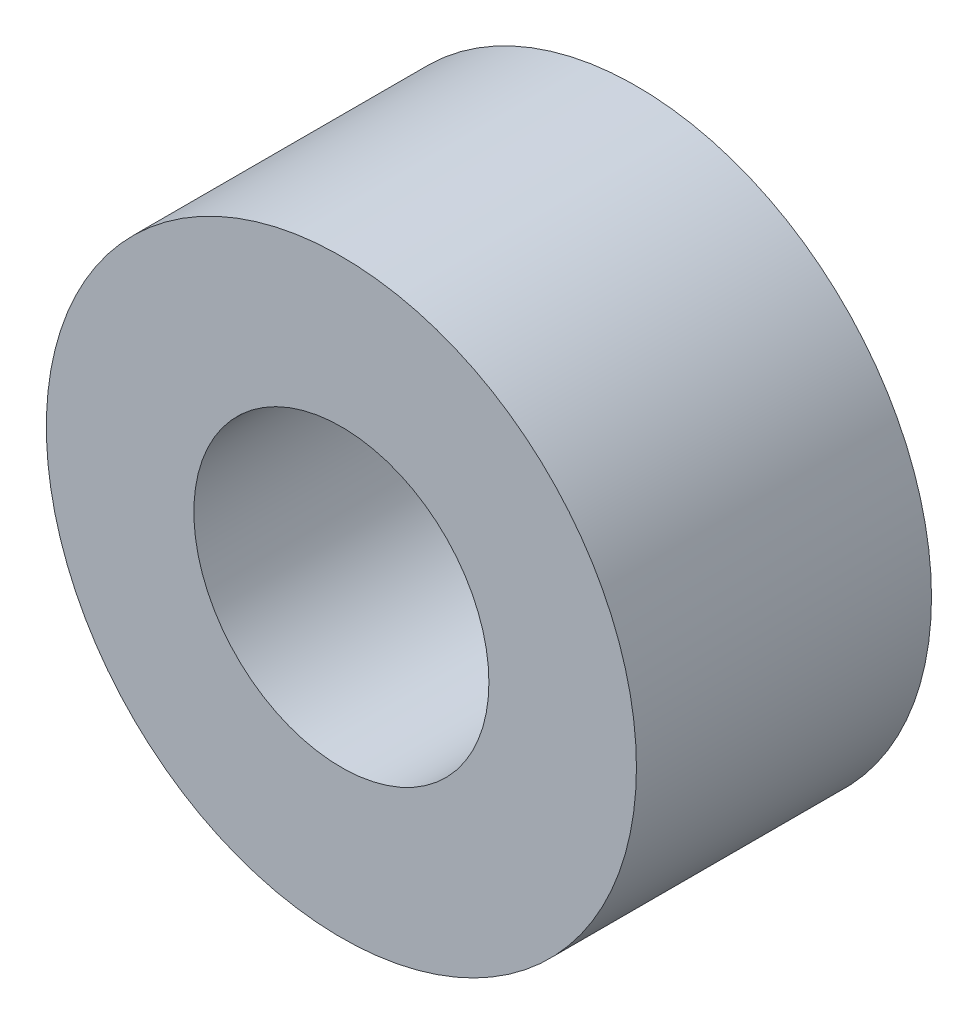
ISO-10303-21;
HEADER;
FILE_DESCRIPTION(('STEP AP214'),'2;1');
FILE_NAME('part.step','',(''),(''),'','','');
FILE_SCHEMA(('AUTOMOTIVE_DESIGN { 1 0 10303 214 1 1 1 1 }'));
ENDSEC;
DATA;
#1=APPLICATION_CONTEXT('core data for automotive mechanical design processes');
#2=APPLICATION_PROTOCOL_DEFINITION('international standard','automotive_design',2000,#1);
#3=PRODUCT_CONTEXT('',#1,'mechanical');
#4=PRODUCT('Part','Part','',(#3));
#5=PRODUCT_RELATED_PRODUCT_CATEGORY('part','',(#4));
#6=PRODUCT_DEFINITION_FORMATION('','',#4);
#7=PRODUCT_DEFINITION_CONTEXT('part definition',#1,'design');
#8=PRODUCT_DEFINITION('design','',#6,#7);
#9=PRODUCT_DEFINITION_SHAPE('','',#8);
#10=(LENGTH_UNIT() NAMED_UNIT(*) SI_UNIT(.MILLI.,.METRE.));
#11=(NAMED_UNIT(*) PLANE_ANGLE_UNIT() SI_UNIT($,.RADIAN.));
#12=(NAMED_UNIT(*) SI_UNIT($,.STERADIAN.) SOLID_ANGLE_UNIT());
#13=UNCERTAINTY_MEASURE_WITH_UNIT(LENGTH_MEASURE(1.E-05),#10,'distance_accuracy_value','');
#14=(GEOMETRIC_REPRESENTATION_CONTEXT(3) GLOBAL_UNCERTAINTY_ASSIGNED_CONTEXT((#13)) GLOBAL_UNIT_ASSIGNED_CONTEXT((#10,
#11,#12)) REPRESENTATION_CONTEXT('',''));
#15=CARTESIAN_POINT('',(0.,0.,0.));
#16=DIRECTION('',(0.,0.,1.));
#17=DIRECTION('',(1.,0.,0.));
#18=AXIS2_PLACEMENT_3D('',#15,#16,#17);
#19=CARTESIAN_POINT('',(0.,0.,3.175));
#20=DIRECTION('',(0.,0.,1.));
#21=DIRECTION('',(1.,0.,0.));
#22=AXIS2_PLACEMENT_3D('',#19,#20,#21);
#23=PLANE('',#22);
#24=CARTESIAN_POINT('',(0.,0.,3.175));
#25=DIRECTION('',(0.,0.,1.));
#26=DIRECTION('',(1.,0.,0.));
#27=AXIS2_PLACEMENT_3D('',#24,#25,#26);
#28=CIRCLE('',#27,3.175);
#29=CARTESIAN_POINT('',(3.175,0.,3.175));
#30=VERTEX_POINT('',#29);
#31=EDGE_CURVE('E10',#30,#30,#28,.T.);
#32=ORIENTED_EDGE('',*,*,#31,.T.);
#33=EDGE_LOOP('',(#32));
#34=FACE_BOUND('',#33,.T.);
#35=CARTESIAN_POINT('',(0.,0.,3.175));
#36=DIRECTION('',(0.,0.,1.));
#37=DIRECTION('',(1.,0.,0.));
#38=AXIS2_PLACEMENT_3D('',#35,#36,#37);
#39=CIRCLE('',#38,1.5875);
#40=CARTESIAN_POINT('',(1.5875,0.,3.175));
#41=VERTEX_POINT('',#40);
#42=EDGE_CURVE('E40',#41,#41,#39,.T.);
#43=ORIENTED_EDGE('',*,*,#42,.F.);
#44=EDGE_LOOP('',(#43));
#45=FACE_BOUND('',#44,.T.);
#46=ADVANCED_FACE('F29',(#34,#45),#23,.T.);
#47=CARTESIAN_POINT('',(0.,0.,0.));
#48=DIRECTION('',(0.,0.,1.));
#49=DIRECTION('',(1.,0.,0.));
#50=AXIS2_PLACEMENT_3D('',#47,#48,#49);
#51=PLANE('',#50);
#52=CARTESIAN_POINT('',(0.,0.,0.));
#53=DIRECTION('',(0.,0.,1.));
#54=DIRECTION('',(1.,0.,0.));
#55=AXIS2_PLACEMENT_3D('',#52,#53,#54);
#56=CIRCLE('',#55,3.175);
#57=CARTESIAN_POINT('',(3.175,0.,0.));
#58=VERTEX_POINT('',#57);
#59=EDGE_CURVE('E33',#58,#58,#56,.T.);
#60=ORIENTED_EDGE('',*,*,#59,.F.);
#61=EDGE_LOOP('',(#60));
#62=FACE_BOUND('',#61,.T.);
#63=CARTESIAN_POINT('',(0.,0.,0.));
#64=DIRECTION('',(0.,0.,1.));
#65=DIRECTION('',(1.,0.,0.));
#66=AXIS2_PLACEMENT_3D('',#63,#64,#65);
#67=CIRCLE('',#66,1.5875);
#68=CARTESIAN_POINT('',(1.5875,0.,0.));
#69=VERTEX_POINT('',#68);
#70=EDGE_CURVE('E42',#69,#69,#67,.T.);
#71=ORIENTED_EDGE('',*,*,#70,.T.);
#72=EDGE_LOOP('',(#71));
#73=FACE_BOUND('',#72,.T.);
#74=ADVANCED_FACE('F52',(#62,#73),#51,.F.);
#75=CARTESIAN_POINT('',(0.,0.,3.175));
#76=DIRECTION('',(0.,0.,-1.));
#77=DIRECTION('',(-1.,0.,0.));
#78=AXIS2_PLACEMENT_3D('',#75,#76,#77);
#79=CYLINDRICAL_SURFACE('',#78,3.175);
#80=ORIENTED_EDGE('',*,*,#31,.F.);
#81=EDGE_LOOP('',(#80));
#82=FACE_BOUND('',#81,.T.);
#83=ORIENTED_EDGE('',*,*,#59,.T.);
#84=EDGE_LOOP('',(#83));
#85=FACE_BOUND('',#84,.T.);
#86=ADVANCED_FACE('F31',(#82,#85),#79,.T.);
#87=CARTESIAN_POINT('',(0.,0.,3.175));
#88=DIRECTION('',(0.,0.,-1.));
#89=DIRECTION('',(-1.,0.,0.));
#90=AXIS2_PLACEMENT_3D('',#87,#88,#89);
#91=CYLINDRICAL_SURFACE('',#90,1.5875);
#92=ORIENTED_EDGE('',*,*,#42,.T.);
#93=EDGE_LOOP('',(#92));
#94=FACE_BOUND('',#93,.T.);
#95=ORIENTED_EDGE('',*,*,#70,.F.);
#96=EDGE_LOOP('',(#95));
#97=FACE_BOUND('',#96,.T.);
#98=ADVANCED_FACE('F48',(#94,#97),#91,.F.);
#99=CLOSED_SHELL('',(#46,#74,#86,#98));
#100=MANIFOLD_SOLID_BREP('B2',#99);
#101=ADVANCED_BREP_SHAPE_REPRESENTATION('',(#18,#100),#14);
#102=SHAPE_DEFINITION_REPRESENTATION(#9,#101);
ENDSEC;
END-ISO-10303-21;
